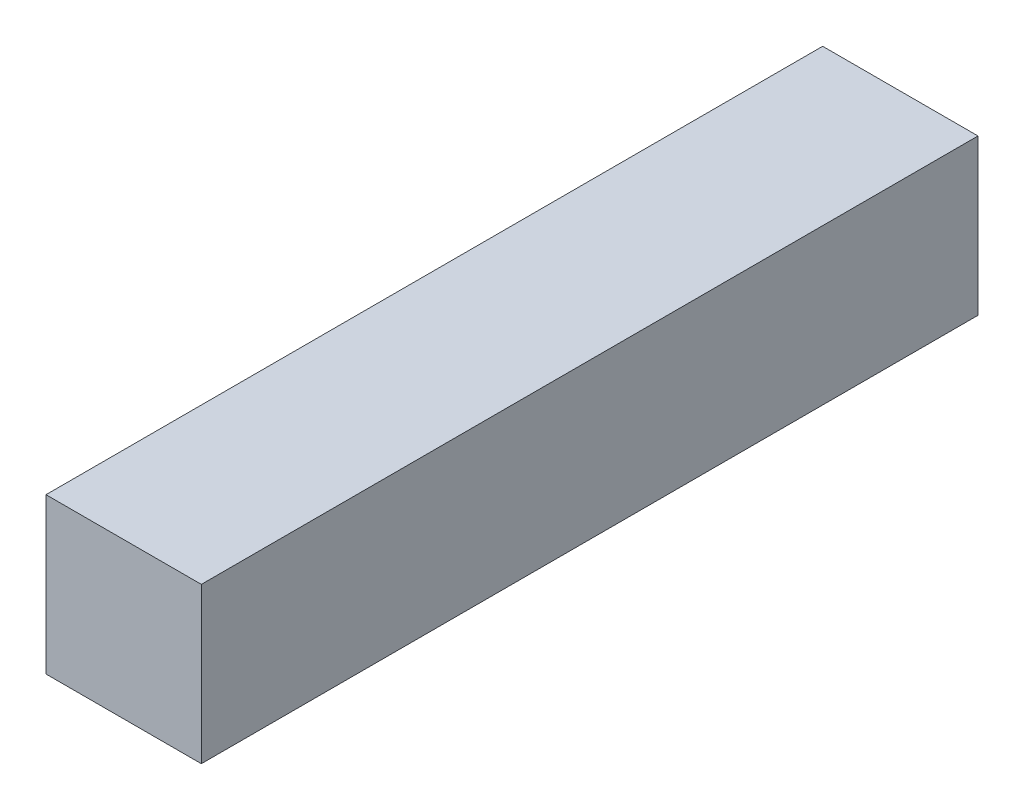
ISO-10303-21;
HEADER;
FILE_DESCRIPTION(('STEP AP214'),'2;1');
FILE_NAME('part.step','',(''),(''),'','','');
FILE_SCHEMA(('AUTOMOTIVE_DESIGN { 1 0 10303 214 1 1 1 1 }'));
ENDSEC;
DATA;
#1=APPLICATION_CONTEXT('core data for automotive mechanical design processes');
#2=APPLICATION_PROTOCOL_DEFINITION('international standard','automotive_design',2000,#1);
#3=PRODUCT_CONTEXT('',#1,'mechanical');
#4=PRODUCT('Part','Part','',(#3));
#5=PRODUCT_RELATED_PRODUCT_CATEGORY('part','',(#4));
#6=PRODUCT_DEFINITION_FORMATION('','',#4);
#7=PRODUCT_DEFINITION_CONTEXT('part definition',#1,'design');
#8=PRODUCT_DEFINITION('design','',#6,#7);
#9=PRODUCT_DEFINITION_SHAPE('','',#8);
#10=(LENGTH_UNIT() NAMED_UNIT(*) SI_UNIT(.MILLI.,.METRE.));
#11=(NAMED_UNIT(*) PLANE_ANGLE_UNIT() SI_UNIT($,.RADIAN.));
#12=(NAMED_UNIT(*) SI_UNIT($,.STERADIAN.) SOLID_ANGLE_UNIT());
#13=UNCERTAINTY_MEASURE_WITH_UNIT(LENGTH_MEASURE(1.E-05),#10,'distance_accuracy_value','');
#14=(GEOMETRIC_REPRESENTATION_CONTEXT(3) GLOBAL_UNCERTAINTY_ASSIGNED_CONTEXT((#13)) GLOBAL_UNIT_ASSIGNED_CONTEXT((#10,
#11,#12)) REPRESENTATION_CONTEXT('',''));
#15=CARTESIAN_POINT('',(0.,0.,0.));
#16=DIRECTION('',(0.,0.,1.));
#17=DIRECTION('',(1.,0.,0.));
#18=AXIS2_PLACEMENT_3D('',#15,#16,#17);
#19=CARTESIAN_POINT('',(2.,0.,0.));
#20=DIRECTION('',(1.,0.,0.));
#21=DIRECTION('',(0.,0.,-1.));
#22=AXIS2_PLACEMENT_3D('',#19,#20,#21);
#23=PLANE('',#22);
#24=DIRECTION('',(0.,1.,0.));
#25=VECTOR('',#24,1.);
#26=CARTESIAN_POINT('',(2.,1.,0.));
#27=LINE('',#26,#25);
#28=CARTESIAN_POINT('',(2.,0.,0.));
#29=VERTEX_POINT('',#28);
#30=CARTESIAN_POINT('',(2.,2.,0.));
#31=VERTEX_POINT('',#30);
#32=EDGE_CURVE('E54',#29,#31,#27,.T.);
#33=ORIENTED_EDGE('',*,*,#32,.T.);
#34=DIRECTION('',(0.,0.,1.));
#35=VECTOR('',#34,1.);
#36=CARTESIAN_POINT('',(2.,2.,0.));
#37=LINE('',#36,#35);
#38=CARTESIAN_POINT('',(2.,2.,10.));
#39=VERTEX_POINT('',#38);
#40=EDGE_CURVE('E66',#39,#31,#37,.F.);
#41=ORIENTED_EDGE('',*,*,#40,.F.);
#42=DIRECTION('',(0.,1.,0.));
#43=VECTOR('',#42,1.);
#44=CARTESIAN_POINT('',(2.,1.,10.));
#45=LINE('',#44,#43);
#46=CARTESIAN_POINT('',(2.,0.,10.));
#47=VERTEX_POINT('',#46);
#48=EDGE_CURVE('E19',#47,#39,#45,.T.);
#49=ORIENTED_EDGE('',*,*,#48,.F.);
#50=DIRECTION('',(0.,0.,1.));
#51=VECTOR('',#50,1.);
#52=CARTESIAN_POINT('',(2.,0.,0.));
#53=LINE('',#52,#51);
#54=EDGE_CURVE('E80',#29,#47,#53,.T.);
#55=ORIENTED_EDGE('',*,*,#54,.F.);
#56=EDGE_LOOP('',(#33,#41,#49,#55));
#57=FACE_BOUND('',#56,.T.);
#58=ADVANCED_FACE('F16',(#57),#23,.T.);
#59=CARTESIAN_POINT('',(1.,1.,10.));
#60=DIRECTION('',(0.,0.,1.));
#61=DIRECTION('',(1.,0.,0.));
#62=AXIS2_PLACEMENT_3D('',#59,#60,#61);
#63=PLANE('',#62);
#64=DIRECTION('',(1.,0.,0.));
#65=VECTOR('',#64,1.);
#66=CARTESIAN_POINT('',(0.,0.,10.));
#67=LINE('',#66,#65);
#68=CARTESIAN_POINT('',(0.,0.,10.));
#69=VERTEX_POINT('',#68);
#70=EDGE_CURVE('E64',#47,#69,#67,.F.);
#71=ORIENTED_EDGE('',*,*,#70,.F.);
#72=ORIENTED_EDGE('',*,*,#48,.T.);
#73=DIRECTION('',(-1.,0.,0.));
#74=VECTOR('',#73,1.);
#75=CARTESIAN_POINT('',(2.,2.,10.));
#76=LINE('',#75,#74);
#77=CARTESIAN_POINT('',(0.,2.,10.));
#78=VERTEX_POINT('',#77);
#79=EDGE_CURVE('E61',#78,#39,#76,.F.);
#80=ORIENTED_EDGE('',*,*,#79,.F.);
#81=DIRECTION('',(0.,-1.,0.));
#82=VECTOR('',#81,1.);
#83=CARTESIAN_POINT('',(0.,2.,10.));
#84=LINE('',#83,#82);
#85=EDGE_CURVE('E82',#69,#78,#84,.F.);
#86=ORIENTED_EDGE('',*,*,#85,.F.);
#87=EDGE_LOOP('',(#71,#72,#80,#86));
#88=FACE_BOUND('',#87,.T.);
#89=ADVANCED_FACE('F59',(#88),#63,.T.);
#90=CARTESIAN_POINT('',(2.,2.,0.));
#91=DIRECTION('',(0.,1.,0.));
#92=DIRECTION('',(-1.,0.,0.));
#93=AXIS2_PLACEMENT_3D('',#90,#91,#92);
#94=PLANE('',#93);
#95=DIRECTION('',(1.,0.,0.));
#96=VECTOR('',#95,1.);
#97=CARTESIAN_POINT('',(1.,2.,0.));
#98=LINE('',#97,#96);
#99=CARTESIAN_POINT('',(0.,2.,0.));
#100=VERTEX_POINT('',#99);
#101=EDGE_CURVE('E76',#31,#100,#98,.F.);
#102=ORIENTED_EDGE('',*,*,#101,.T.);
#103=DIRECTION('',(0.,0.,1.));
#104=VECTOR('',#103,1.);
#105=CARTESIAN_POINT('',(0.,2.,0.));
#106=LINE('',#105,#104);
#107=EDGE_CURVE('E72',#78,#100,#106,.F.);
#108=ORIENTED_EDGE('',*,*,#107,.F.);
#109=ORIENTED_EDGE('',*,*,#79,.T.);
#110=ORIENTED_EDGE('',*,*,#40,.T.);
#111=EDGE_LOOP('',(#102,#108,#109,#110));
#112=FACE_BOUND('',#111,.T.);
#113=ADVANCED_FACE('F70',(#112),#94,.T.);
#114=CARTESIAN_POINT('',(1.,1.,0.));
#115=DIRECTION('',(0.,0.,1.));
#116=DIRECTION('',(1.,0.,0.));
#117=AXIS2_PLACEMENT_3D('',#114,#115,#116);
#118=PLANE('',#117);
#119=ORIENTED_EDGE('',*,*,#101,.F.);
#120=ORIENTED_EDGE('',*,*,#32,.F.);
#121=DIRECTION('',(1.,0.,0.));
#122=VECTOR('',#121,1.);
#123=CARTESIAN_POINT('',(0.,0.,0.));
#124=LINE('',#123,#122);
#125=CARTESIAN_POINT('',(0.,0.,0.));
#126=VERTEX_POINT('',#125);
#127=EDGE_CURVE('E34',#126,#29,#124,.T.);
#128=ORIENTED_EDGE('',*,*,#127,.F.);
#129=DIRECTION('',(0.,-1.,0.));
#130=VECTOR('',#129,1.);
#131=CARTESIAN_POINT('',(0.,2.,0.));
#132=LINE('',#131,#130);
#133=EDGE_CURVE('E25',#100,#126,#132,.T.);
#134=ORIENTED_EDGE('',*,*,#133,.F.);
#135=EDGE_LOOP('',(#119,#120,#128,#134));
#136=FACE_BOUND('',#135,.T.);
#137=ADVANCED_FACE('F88',(#136),#118,.F.);
#138=CARTESIAN_POINT('',(0.,0.,0.));
#139=DIRECTION('',(0.,-1.,0.));
#140=DIRECTION('',(1.,0.,0.));
#141=AXIS2_PLACEMENT_3D('',#138,#139,#140);
#142=PLANE('',#141);
#143=ORIENTED_EDGE('',*,*,#127,.T.);
#144=ORIENTED_EDGE('',*,*,#54,.T.);
#145=ORIENTED_EDGE('',*,*,#70,.T.);
#146=DIRECTION('',(0.,0.,1.));
#147=VECTOR('',#146,1.);
#148=CARTESIAN_POINT('',(0.,0.,0.));
#149=LINE('',#148,#147);
#150=EDGE_CURVE('E11',#126,#69,#149,.T.);
#151=ORIENTED_EDGE('',*,*,#150,.F.);
#152=EDGE_LOOP('',(#143,#144,#145,#151));
#153=FACE_BOUND('',#152,.T.);
#154=ADVANCED_FACE('F90',(#153),#142,.T.);
#155=CARTESIAN_POINT('',(0.,2.,0.));
#156=DIRECTION('',(-1.,0.,0.));
#157=DIRECTION('',(0.,-1.,0.));
#158=AXIS2_PLACEMENT_3D('',#155,#156,#157);
#159=PLANE('',#158);
#160=ORIENTED_EDGE('',*,*,#133,.T.);
#161=ORIENTED_EDGE('',*,*,#150,.T.);
#162=ORIENTED_EDGE('',*,*,#85,.T.);
#163=ORIENTED_EDGE('',*,*,#107,.T.);
#164=EDGE_LOOP('',(#160,#161,#162,#163));
#165=FACE_BOUND('',#164,.T.);
#166=ADVANCED_FACE('F87',(#165),#159,.T.);
#167=CLOSED_SHELL('',(#58,#89,#113,#137,#154,#166));
#168=MANIFOLD_SOLID_BREP('B1',#167);
#169=ADVANCED_BREP_SHAPE_REPRESENTATION('',(#18,#168),#14);
#170=SHAPE_DEFINITION_REPRESENTATION(#9,#169);
ENDSEC;
END-ISO-10303-21;
